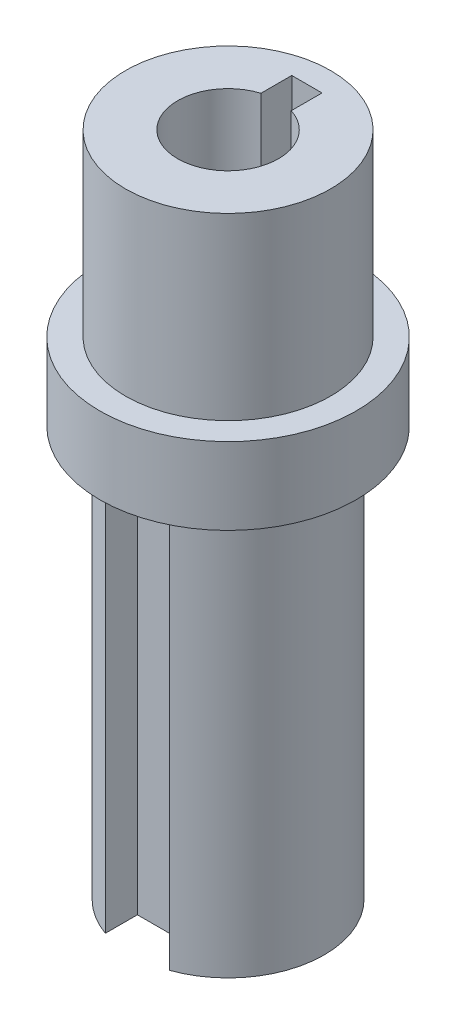
ISO-10303-21;
HEADER;
FILE_DESCRIPTION(('STEP AP214'),'2;1');
FILE_NAME('part.step','',(''),(''),'','','');
FILE_SCHEMA(('AUTOMOTIVE_DESIGN { 1 0 10303 214 1 1 1 1 }'));
ENDSEC;
DATA;
#1=APPLICATION_CONTEXT('core data for automotive mechanical design processes');
#2=APPLICATION_PROTOCOL_DEFINITION('international standard','automotive_design',2000,#1);
#3=PRODUCT_CONTEXT('',#1,'mechanical');
#4=PRODUCT('Part','Part','',(#3));
#5=PRODUCT_RELATED_PRODUCT_CATEGORY('part','',(#4));
#6=PRODUCT_DEFINITION_FORMATION('','',#4);
#7=PRODUCT_DEFINITION_CONTEXT('part definition',#1,'design');
#8=PRODUCT_DEFINITION('design','',#6,#7);
#9=PRODUCT_DEFINITION_SHAPE('','',#8);
#10=(LENGTH_UNIT() NAMED_UNIT(*) SI_UNIT(.MILLI.,.METRE.));
#11=(NAMED_UNIT(*) PLANE_ANGLE_UNIT() SI_UNIT($,.RADIAN.));
#12=(NAMED_UNIT(*) SI_UNIT($,.STERADIAN.) SOLID_ANGLE_UNIT());
#13=UNCERTAINTY_MEASURE_WITH_UNIT(LENGTH_MEASURE(1.E-05),#10,'distance_accuracy_value','');
#14=(GEOMETRIC_REPRESENTATION_CONTEXT(3) GLOBAL_UNCERTAINTY_ASSIGNED_CONTEXT((#13)) GLOBAL_UNIT_ASSIGNED_CONTEXT((#10,
#11,#12)) REPRESENTATION_CONTEXT('',''));
#15=CARTESIAN_POINT('',(0.,0.,0.));
#16=DIRECTION('',(0.,0.,1.));
#17=DIRECTION('',(1.,0.,0.));
#18=AXIS2_PLACEMENT_3D('',#15,#16,#17);
#19=CARTESIAN_POINT('',(-12.7,-17.78,0.));
#20=DIRECTION('',(0.,-1.,0.));
#21=DIRECTION('',(0.,0.,-1.));
#22=AXIS2_PLACEMENT_3D('',#19,#20,#21);
#23=PLANE('',#22);
#24=CARTESIAN_POINT('',(0.,-17.78,0.));
#25=DIRECTION('',(0.,1.,0.));
#26=DIRECTION('',(0.,0.,1.));
#27=AXIS2_PLACEMENT_3D('',#24,#25,#26);
#28=CIRCLE('',#27,10.16);
#29=CARTESIAN_POINT('',(0.,-17.78,10.16));
#30=VERTEX_POINT('',#29);
#31=EDGE_CURVE('E153',#30,#30,#28,.T.);
#32=ORIENTED_EDGE('',*,*,#31,.F.);
#33=EDGE_LOOP('',(#32));
#34=FACE_BOUND('',#33,.T.);
#35=CARTESIAN_POINT('',(0.,-17.78,0.));
#36=DIRECTION('',(0.,1.,0.));
#37=DIRECTION('',(0.,0.,1.));
#38=AXIS2_PLACEMENT_3D('',#35,#36,#37);
#39=CIRCLE('',#38,12.7);
#40=CARTESIAN_POINT('',(0.,-17.78,12.7));
#41=VERTEX_POINT('',#40);
#42=EDGE_CURVE('E11',#41,#41,#39,.T.);
#43=ORIENTED_EDGE('',*,*,#42,.T.);
#44=EDGE_LOOP('',(#43));
#45=FACE_BOUND('',#44,.T.);
#46=ADVANCED_FACE('F37',(#34,#45),#23,.F.);
#47=CARTESIAN_POINT('',(0.,0.,0.));
#48=DIRECTION('',(0.,1.,0.));
#49=DIRECTION('',(0.,0.,1.));
#50=AXIS2_PLACEMENT_3D('',#47,#48,#49);
#51=CYLINDRICAL_SURFACE('',#50,12.7);
#52=ORIENTED_EDGE('',*,*,#42,.F.);
#53=EDGE_LOOP('',(#52));
#54=FACE_BOUND('',#53,.T.);
#55=CARTESIAN_POINT('',(0.,-25.4,0.));
#56=DIRECTION('',(0.,1.,0.));
#57=DIRECTION('',(0.,0.,1.));
#58=AXIS2_PLACEMENT_3D('',#55,#56,#57);
#59=CIRCLE('',#58,12.7);
#60=CARTESIAN_POINT('',(0.,-25.4,12.7));
#61=VERTEX_POINT('',#60);
#62=EDGE_CURVE('E44',#61,#61,#59,.T.);
#63=ORIENTED_EDGE('',*,*,#62,.T.);
#64=EDGE_LOOP('',(#63));
#65=FACE_BOUND('',#64,.T.);
#66=ADVANCED_FACE('F182',(#54,#65),#51,.T.);
#67=CARTESIAN_POINT('',(-9.525,-25.4,0.));
#68=DIRECTION('',(0.,1.,0.));
#69=DIRECTION('',(0.,0.,1.));
#70=AXIS2_PLACEMENT_3D('',#67,#68,#69);
#71=PLANE('',#70);
#72=ORIENTED_EDGE('',*,*,#62,.F.);
#73=EDGE_LOOP('',(#72));
#74=FACE_BOUND('',#73,.T.);
#75=CARTESIAN_POINT('',(0.,-25.4,0.));
#76=DIRECTION('',(0.,1.,0.));
#77=DIRECTION('',(0.,0.,1.));
#78=AXIS2_PLACEMENT_3D('',#75,#76,#77);
#79=CIRCLE('',#78,9.525);
#80=CARTESIAN_POINT('',(0.,-25.4,9.525));
#81=VERTEX_POINT('',#80);
#82=EDGE_CURVE('E177',#81,#81,#79,.T.);
#83=ORIENTED_EDGE('',*,*,#82,.T.);
#84=EDGE_LOOP('',(#83));
#85=FACE_BOUND('',#84,.T.);
#86=ADVANCED_FACE('F184',(#74,#85),#71,.F.);
#87=CARTESIAN_POINT('',(0.,0.,0.));
#88=DIRECTION('',(0.,1.,0.));
#89=DIRECTION('',(0.,0.,1.));
#90=AXIS2_PLACEMENT_3D('',#87,#88,#89);
#91=CYLINDRICAL_SURFACE('',#90,9.525);
#92=ORIENTED_EDGE('',*,*,#82,.F.);
#93=EDGE_LOOP('',(#92));
#94=FACE_BOUND('',#93,.T.);
#95=CARTESIAN_POINT('',(0.,-26.67,0.));
#96=DIRECTION('',(0.,-1.,0.));
#97=DIRECTION('',(0.,0.,1.));
#98=AXIS2_PLACEMENT_3D('',#95,#96,#97);
#99=CIRCLE('',#98,9.525);
#100=CARTESIAN_POINT('',(3.175,-26.67,8.98025612106916));
#101=VERTEX_POINT('',#100);
#102=CARTESIAN_POINT('',(-3.175,-26.67,8.98025612106916));
#103=VERTEX_POINT('',#102);
#104=EDGE_CURVE('E109',#101,#103,#99,.T.);
#105=ORIENTED_EDGE('',*,*,#104,.F.);
#106=DIRECTION('',(0.,-1.,0.));
#107=VECTOR('',#106,1.);
#108=CARTESIAN_POINT('',(3.175,-26.67,8.98025612106916));
#109=LINE('',#108,#107);
#110=CARTESIAN_POINT('',(3.175,-66.04,8.98025612106916));
#111=VERTEX_POINT('',#110);
#112=EDGE_CURVE('E147',#101,#111,#109,.T.);
#113=ORIENTED_EDGE('',*,*,#112,.T.);
#114=CARTESIAN_POINT('',(0.,-66.04,0.));
#115=DIRECTION('',(0.,1.,0.));
#116=DIRECTION('',(0.,0.,1.));
#117=AXIS2_PLACEMENT_3D('',#114,#115,#116);
#118=CIRCLE('',#117,9.525);
#119=CARTESIAN_POINT('',(-3.175,-66.04,8.98025612106916));
#120=VERTEX_POINT('',#119);
#121=EDGE_CURVE('E123',#111,#120,#118,.T.);
#122=ORIENTED_EDGE('',*,*,#121,.T.);
#123=DIRECTION('',(0.,-1.,0.));
#124=VECTOR('',#123,1.);
#125=CARTESIAN_POINT('',(-3.175,-26.67,8.98025612106916));
#126=LINE('',#125,#124);
#127=EDGE_CURVE('E51',#103,#120,#126,.T.);
#128=ORIENTED_EDGE('',*,*,#127,.F.);
#129=EDGE_LOOP('',(#105,#113,#122,#128));
#130=FACE_BOUND('',#129,.T.);
#131=ADVANCED_FACE('F121',(#94,#130),#91,.T.);
#132=CARTESIAN_POINT('',(-2.032,-66.04,0.));
#133=DIRECTION('',(0.,1.,0.));
#134=DIRECTION('',(0.,0.,1.));
#135=AXIS2_PLACEMENT_3D('',#132,#133,#134);
#136=PLANE('',#135);
#137=ORIENTED_EDGE('',*,*,#121,.F.);
#138=DIRECTION('',(0.,0.,1.));
#139=VECTOR('',#138,1.);
#140=CARTESIAN_POINT('',(3.175,-66.04,5.80525612106916));
#141=LINE('',#140,#139);
#142=CARTESIAN_POINT('',(3.175,-66.04,5.80525612106916));
#143=VERTEX_POINT('',#142);
#144=EDGE_CURVE('E118',#143,#111,#141,.T.);
#145=ORIENTED_EDGE('',*,*,#144,.F.);
#146=DIRECTION('',(1.,0.,0.));
#147=VECTOR('',#146,1.);
#148=CARTESIAN_POINT('',(-3.175,-66.04,5.80525612106916));
#149=LINE('',#148,#147);
#150=CARTESIAN_POINT('',(-3.175,-66.04,5.80525612106916));
#151=VERTEX_POINT('',#150);
#152=EDGE_CURVE('E412',#151,#143,#149,.T.);
#153=ORIENTED_EDGE('',*,*,#152,.F.);
#154=DIRECTION('',(0.,0.,-1.));
#155=VECTOR('',#154,1.);
#156=CARTESIAN_POINT('',(-3.175,-66.04,8.98025612106916));
#157=LINE('',#156,#155);
#158=EDGE_CURVE('E416',#120,#151,#157,.T.);
#159=ORIENTED_EDGE('',*,*,#158,.F.);
#160=EDGE_LOOP('',(#137,#145,#153,#159));
#161=FACE_BOUND('',#160,.T.);
#162=CARTESIAN_POINT('',(0.,-66.04,0.));
#163=DIRECTION('',(0.,1.,0.));
#164=DIRECTION('',(0.,0.,1.));
#165=AXIS2_PLACEMENT_3D('',#162,#163,#164);
#166=CIRCLE('',#165,2.032);
#167=CARTESIAN_POINT('',(0.,-66.04,2.032));
#168=VERTEX_POINT('',#167);
#169=EDGE_CURVE('E173',#168,#168,#166,.T.);
#170=ORIENTED_EDGE('',*,*,#169,.T.);
#171=EDGE_LOOP('',(#170));
#172=FACE_BOUND('',#171,.T.);
#173=ADVANCED_FACE('F191',(#161,#172),#136,.F.);
#174=CARTESIAN_POINT('',(0.,0.,0.));
#175=DIRECTION('',(0.,1.,0.));
#176=DIRECTION('',(0.,0.,1.));
#177=AXIS2_PLACEMENT_3D('',#174,#175,#176);
#178=CYLINDRICAL_SURFACE('',#177,2.032);
#179=ORIENTED_EDGE('',*,*,#169,.F.);
#180=EDGE_LOOP('',(#179));
#181=FACE_BOUND('',#180,.T.);
#182=CARTESIAN_POINT('',(0.,-34.29,0.));
#183=DIRECTION('',(0.,1.,0.));
#184=DIRECTION('',(0.,0.,1.));
#185=AXIS2_PLACEMENT_3D('',#182,#183,#184);
#186=CIRCLE('',#185,2.032);
#187=CARTESIAN_POINT('',(0.,-34.29,2.032));
#188=VERTEX_POINT('',#187);
#189=EDGE_CURVE('E170',#188,#188,#186,.T.);
#190=ORIENTED_EDGE('',*,*,#189,.T.);
#191=EDGE_LOOP('',(#190));
#192=FACE_BOUND('',#191,.T.);
#193=ADVANCED_FACE('F196',(#181,#192),#178,.F.);
#194=CARTESIAN_POINT('',(-4.9911,-34.29,0.));
#195=DIRECTION('',(0.,-1.,0.));
#196=DIRECTION('',(0.,0.,-1.));
#197=AXIS2_PLACEMENT_3D('',#194,#195,#196);
#198=PLANE('',#197);
#199=ORIENTED_EDGE('',*,*,#189,.F.);
#200=EDGE_LOOP('',(#199));
#201=FACE_BOUND('',#200,.T.);
#202=CARTESIAN_POINT('',(0.,-34.29,0.));
#203=DIRECTION('',(0.,1.,0.));
#204=DIRECTION('',(0.,0.,1.));
#205=AXIS2_PLACEMENT_3D('',#202,#203,#204);
#206=CIRCLE('',#205,4.9911);
#207=CARTESIAN_POINT('',(0.,-34.29,4.9911));
#208=VERTEX_POINT('',#207);
#209=EDGE_CURVE('E167',#208,#208,#206,.T.);
#210=ORIENTED_EDGE('',*,*,#209,.T.);
#211=EDGE_LOOP('',(#210));
#212=FACE_BOUND('',#211,.T.);
#213=ADVANCED_FACE('F230',(#201,#212),#198,.F.);
#214=CARTESIAN_POINT('',(0.,0.,0.));
#215=DIRECTION('',(0.,1.,0.));
#216=DIRECTION('',(0.,0.,1.));
#217=AXIS2_PLACEMENT_3D('',#214,#215,#216);
#218=CYLINDRICAL_SURFACE('',#217,4.9911);
#219=ORIENTED_EDGE('',*,*,#209,.F.);
#220=EDGE_LOOP('',(#219));
#221=FACE_BOUND('',#220,.T.);
#222=CARTESIAN_POINT('',(0.,-21.8,0.));
#223=DIRECTION('',(0.,-1.,0.));
#224=DIRECTION('',(0.,0.,-1.));
#225=AXIS2_PLACEMENT_3D('',#222,#223,#224);
#226=CIRCLE('',#225,4.9911);
#227=CARTESIAN_POINT('',(-1.5,-21.8,-4.76036544920661));
#228=VERTEX_POINT('',#227);
#229=CARTESIAN_POINT('',(1.5,-21.8,-4.76036544920661));
#230=VERTEX_POINT('',#229);
#231=EDGE_CURVE('E133',#228,#230,#226,.T.);
#232=ORIENTED_EDGE('',*,*,#231,.F.);
#233=DIRECTION('',(0.,1.,0.));
#234=VECTOR('',#233,1.);
#235=CARTESIAN_POINT('',(-1.5,-21.8,-4.76036544920661));
#236=LINE('',#235,#234);
#237=CARTESIAN_POINT('',(-1.5,0.,-4.76036544920661));
#238=VERTEX_POINT('',#237);
#239=EDGE_CURVE('E143',#228,#238,#236,.T.);
#240=ORIENTED_EDGE('',*,*,#239,.T.);
#241=CARTESIAN_POINT('',(0.,0.,0.));
#242=DIRECTION('',(0.,1.,0.));
#243=DIRECTION('',(0.,0.,1.));
#244=AXIS2_PLACEMENT_3D('',#241,#242,#243);
#245=CIRCLE('',#244,4.9911);
#246=CARTESIAN_POINT('',(1.5,0.,-4.76036544920661));
#247=VERTEX_POINT('',#246);
#248=EDGE_CURVE('E164',#238,#247,#245,.T.);
#249=ORIENTED_EDGE('',*,*,#248,.T.);
#250=DIRECTION('',(0.,1.,0.));
#251=VECTOR('',#250,1.);
#252=CARTESIAN_POINT('',(1.5,-21.8,-4.76036544920661));
#253=LINE('',#252,#251);
#254=EDGE_CURVE('E59',#230,#247,#253,.T.);
#255=ORIENTED_EDGE('',*,*,#254,.F.);
#256=EDGE_LOOP('',(#232,#240,#249,#255));
#257=FACE_BOUND('',#256,.T.);
#258=ADVANCED_FACE('F222',(#221,#257),#218,.F.);
#259=CARTESIAN_POINT('',(-10.16,0.,0.));
#260=DIRECTION('',(0.,-1.,0.));
#261=DIRECTION('',(0.,0.,-1.));
#262=AXIS2_PLACEMENT_3D('',#259,#260,#261);
#263=PLANE('',#262);
#264=ORIENTED_EDGE('',*,*,#248,.F.);
#265=DIRECTION('',(0.,0.,1.));
#266=VECTOR('',#265,1.);
#267=CARTESIAN_POINT('',(-1.5,0.,-4.76036544920661));
#268=LINE('',#267,#266);
#269=CARTESIAN_POINT('',(-1.5,0.,-7.81));
#270=VERTEX_POINT('',#269);
#271=EDGE_CURVE('E144',#270,#238,#268,.T.);
#272=ORIENTED_EDGE('',*,*,#271,.F.);
#273=DIRECTION('',(-1.,0.,0.));
#274=VECTOR('',#273,1.);
#275=CARTESIAN_POINT('',(1.5,0.,-7.81));
#276=LINE('',#275,#274);
#277=CARTESIAN_POINT('',(1.5,0.,-7.81));
#278=VERTEX_POINT('',#277);
#279=EDGE_CURVE('E134',#278,#270,#276,.T.);
#280=ORIENTED_EDGE('',*,*,#279,.F.);
#281=DIRECTION('',(0.,0.,-1.));
#282=VECTOR('',#281,1.);
#283=CARTESIAN_POINT('',(1.5,0.,-4.76036544920661));
#284=LINE('',#283,#282);
#285=EDGE_CURVE('E146',#247,#278,#284,.T.);
#286=ORIENTED_EDGE('',*,*,#285,.F.);
#287=EDGE_LOOP('',(#264,#272,#280,#286));
#288=FACE_BOUND('',#287,.T.);
#289=CARTESIAN_POINT('',(0.,0.,0.));
#290=DIRECTION('',(0.,1.,0.));
#291=DIRECTION('',(0.,0.,1.));
#292=AXIS2_PLACEMENT_3D('',#289,#290,#291);
#293=CIRCLE('',#292,10.16);
#294=CARTESIAN_POINT('',(0.,0.,10.16));
#295=VERTEX_POINT('',#294);
#296=EDGE_CURVE('E161',#295,#295,#293,.T.);
#297=ORIENTED_EDGE('',*,*,#296,.T.);
#298=EDGE_LOOP('',(#297));
#299=FACE_BOUND('',#298,.T.);
#300=ADVANCED_FACE('F212',(#288,#299),#263,.F.);
#301=CARTESIAN_POINT('',(0.,0.,0.));
#302=DIRECTION('',(0.,1.,0.));
#303=DIRECTION('',(0.,0.,1.));
#304=AXIS2_PLACEMENT_3D('',#301,#302,#303);
#305=CYLINDRICAL_SURFACE('',#304,10.16);
#306=ORIENTED_EDGE('',*,*,#296,.F.);
#307=EDGE_LOOP('',(#306));
#308=FACE_BOUND('',#307,.T.);
#309=ORIENTED_EDGE('',*,*,#31,.T.);
#310=EDGE_LOOP('',(#309));
#311=FACE_BOUND('',#310,.T.);
#312=ADVANCED_FACE('F209',(#308,#311),#305,.T.);
#313=CARTESIAN_POINT('',(-1.5,-21.8,-4.76036544920661));
#314=DIRECTION('',(-1.,0.,0.));
#315=DIRECTION('',(0.,0.,1.));
#316=AXIS2_PLACEMENT_3D('',#313,#314,#315);
#317=PLANE('',#316);
#318=ORIENTED_EDGE('',*,*,#271,.T.);
#319=ORIENTED_EDGE('',*,*,#239,.F.);
#320=DIRECTION('',(0.,0.,1.));
#321=VECTOR('',#320,1.);
#322=CARTESIAN_POINT('',(-1.5,-21.8,-4.76036544920661));
#323=LINE('',#322,#321);
#324=CARTESIAN_POINT('',(-1.5,-21.8,-7.81));
#325=VERTEX_POINT('',#324);
#326=EDGE_CURVE('E130',#325,#228,#323,.T.);
#327=ORIENTED_EDGE('',*,*,#326,.F.);
#328=DIRECTION('',(0.,1.,0.));
#329=VECTOR('',#328,1.);
#330=CARTESIAN_POINT('',(-1.5,-21.8,-7.81));
#331=LINE('',#330,#329);
#332=EDGE_CURVE('E151',#325,#270,#331,.T.);
#333=ORIENTED_EDGE('',*,*,#332,.T.);
#334=EDGE_LOOP('',(#318,#319,#327,#333));
#335=FACE_BOUND('',#334,.T.);
#336=ADVANCED_FACE('F211',(#335),#317,.F.);
#337=CARTESIAN_POINT('',(1.5,-21.8,-7.81));
#338=DIRECTION('',(0.,0.,-1.));
#339=DIRECTION('',(-1.,0.,0.));
#340=AXIS2_PLACEMENT_3D('',#337,#338,#339);
#341=PLANE('',#340);
#342=ORIENTED_EDGE('',*,*,#279,.T.);
#343=ORIENTED_EDGE('',*,*,#332,.F.);
#344=DIRECTION('',(-1.,0.,0.));
#345=VECTOR('',#344,1.);
#346=CARTESIAN_POINT('',(1.5,-21.8,-7.81));
#347=LINE('',#346,#345);
#348=CARTESIAN_POINT('',(1.5,-21.8,-7.81));
#349=VERTEX_POINT('',#348);
#350=EDGE_CURVE('E140',#349,#325,#347,.T.);
#351=ORIENTED_EDGE('',*,*,#350,.F.);
#352=DIRECTION('',(0.,1.,0.));
#353=VECTOR('',#352,1.);
#354=CARTESIAN_POINT('',(1.5,-21.8,-7.81));
#355=LINE('',#354,#353);
#356=EDGE_CURVE('E154',#349,#278,#355,.T.);
#357=ORIENTED_EDGE('',*,*,#356,.T.);
#358=EDGE_LOOP('',(#342,#343,#351,#357));
#359=FACE_BOUND('',#358,.T.);
#360=ADVANCED_FACE('F219',(#359),#341,.F.);
#361=CARTESIAN_POINT('',(1.5,-21.8,-4.76036544920661));
#362=DIRECTION('',(1.,0.,0.));
#363=DIRECTION('',(0.,0.,-1.));
#364=AXIS2_PLACEMENT_3D('',#361,#362,#363);
#365=PLANE('',#364);
#366=ORIENTED_EDGE('',*,*,#285,.T.);
#367=ORIENTED_EDGE('',*,*,#356,.F.);
#368=DIRECTION('',(0.,0.,-1.));
#369=VECTOR('',#368,1.);
#370=CARTESIAN_POINT('',(1.5,-21.8,-4.76036544920661));
#371=LINE('',#370,#369);
#372=EDGE_CURVE('E137',#230,#349,#371,.T.);
#373=ORIENTED_EDGE('',*,*,#372,.F.);
#374=ORIENTED_EDGE('',*,*,#254,.T.);
#375=EDGE_LOOP('',(#366,#367,#373,#374));
#376=FACE_BOUND('',#375,.T.);
#377=ADVANCED_FACE('F254',(#376),#365,.F.);
#378=CARTESIAN_POINT('',(0.,-21.8,0.));
#379=DIRECTION('',(0.,-1.,0.));
#380=DIRECTION('',(0.,0.,-1.));
#381=AXIS2_PLACEMENT_3D('',#378,#379,#380);
#382=PLANE('',#381);
#383=ORIENTED_EDGE('',*,*,#326,.T.);
#384=ORIENTED_EDGE('',*,*,#231,.T.);
#385=ORIENTED_EDGE('',*,*,#372,.T.);
#386=ORIENTED_EDGE('',*,*,#350,.T.);
#387=EDGE_LOOP('',(#383,#384,#385,#386));
#388=FACE_BOUND('',#387,.T.);
#389=ADVANCED_FACE('F248',(#388),#382,.F.);
#390=CARTESIAN_POINT('',(3.175,-26.67,5.80525612106916));
#391=DIRECTION('',(1.,0.,0.));
#392=DIRECTION('',(0.,0.,-1.));
#393=AXIS2_PLACEMENT_3D('',#390,#391,#392);
#394=PLANE('',#393);
#395=ORIENTED_EDGE('',*,*,#144,.T.);
#396=ORIENTED_EDGE('',*,*,#112,.F.);
#397=DIRECTION('',(0.,0.,1.));
#398=VECTOR('',#397,1.);
#399=CARTESIAN_POINT('',(3.175,-26.67,5.80525612106916));
#400=LINE('',#399,#398);
#401=CARTESIAN_POINT('',(3.175,-26.67,5.80525612106916));
#402=VERTEX_POINT('',#401);
#403=EDGE_CURVE('E115',#402,#101,#400,.T.);
#404=ORIENTED_EDGE('',*,*,#403,.F.);
#405=DIRECTION('',(0.,-1.,0.));
#406=VECTOR('',#405,1.);
#407=CARTESIAN_POINT('',(3.175,-26.67,5.80525612106916));
#408=LINE('',#407,#406);
#409=EDGE_CURVE('E125',#402,#143,#408,.T.);
#410=ORIENTED_EDGE('',*,*,#409,.T.);
#411=EDGE_LOOP('',(#395,#396,#404,#410));
#412=FACE_BOUND('',#411,.T.);
#413=ADVANCED_FACE('F264',(#412),#394,.F.);
#414=CARTESIAN_POINT('',(-3.175,-26.67,5.80525612106916));
#415=DIRECTION('',(0.,0.,-1.));
#416=DIRECTION('',(-1.,0.,0.));
#417=AXIS2_PLACEMENT_3D('',#414,#415,#416);
#418=PLANE('',#417);
#419=ORIENTED_EDGE('',*,*,#152,.T.);
#420=ORIENTED_EDGE('',*,*,#409,.F.);
#421=DIRECTION('',(1.,0.,0.));
#422=VECTOR('',#421,1.);
#423=CARTESIAN_POINT('',(-3.175,-26.67,5.80525612106916));
#424=LINE('',#423,#422);
#425=CARTESIAN_POINT('',(-3.175,-26.67,5.80525612106916));
#426=VERTEX_POINT('',#425);
#427=EDGE_CURVE('E108',#426,#402,#424,.T.);
#428=ORIENTED_EDGE('',*,*,#427,.F.);
#429=DIRECTION('',(0.,-1.,0.));
#430=VECTOR('',#429,1.);
#431=CARTESIAN_POINT('',(-3.175,-26.67,5.80525612106916));
#432=LINE('',#431,#430);
#433=EDGE_CURVE('E104',#426,#151,#432,.T.);
#434=ORIENTED_EDGE('',*,*,#433,.T.);
#435=EDGE_LOOP('',(#419,#420,#428,#434));
#436=FACE_BOUND('',#435,.T.);
#437=ADVANCED_FACE('F267',(#436),#418,.F.);
#438=CARTESIAN_POINT('',(-3.175,-26.67,8.98025612106916));
#439=DIRECTION('',(-1.,0.,0.));
#440=DIRECTION('',(0.,0.,1.));
#441=AXIS2_PLACEMENT_3D('',#438,#439,#440);
#442=PLANE('',#441);
#443=ORIENTED_EDGE('',*,*,#158,.T.);
#444=ORIENTED_EDGE('',*,*,#433,.F.);
#445=DIRECTION('',(0.,0.,-1.));
#446=VECTOR('',#445,1.);
#447=CARTESIAN_POINT('',(-3.175,-26.67,8.98025612106916));
#448=LINE('',#447,#446);
#449=EDGE_CURVE('E101',#103,#426,#448,.T.);
#450=ORIENTED_EDGE('',*,*,#449,.F.);
#451=ORIENTED_EDGE('',*,*,#127,.T.);
#452=EDGE_LOOP('',(#443,#444,#450,#451));
#453=FACE_BOUND('',#452,.T.);
#454=ADVANCED_FACE('F103',(#453),#442,.F.);
#455=CARTESIAN_POINT('',(0.,-26.67,0.));
#456=DIRECTION('',(0.,1.,0.));
#457=DIRECTION('',(0.,0.,1.));
#458=AXIS2_PLACEMENT_3D('',#455,#456,#457);
#459=PLANE('',#458);
#460=ORIENTED_EDGE('',*,*,#104,.T.);
#461=ORIENTED_EDGE('',*,*,#449,.T.);
#462=ORIENTED_EDGE('',*,*,#427,.T.);
#463=ORIENTED_EDGE('',*,*,#403,.T.);
#464=EDGE_LOOP('',(#460,#461,#462,#463));
#465=FACE_BOUND('',#464,.T.);
#466=ADVANCED_FACE('F113',(#465),#459,.F.);
#467=CLOSED_SHELL('',(#46,#66,#86,#131,#173,#193,#213,#258,#300,#312,#336,#360,#377,#389,#413,
#437,#454,#466));
#468=MANIFOLD_SOLID_BREP('B2',#467);
#469=ADVANCED_BREP_SHAPE_REPRESENTATION('',(#18,#468),#14);
#470=SHAPE_DEFINITION_REPRESENTATION(#9,#469);
ENDSEC;
END-ISO-10303-21;
